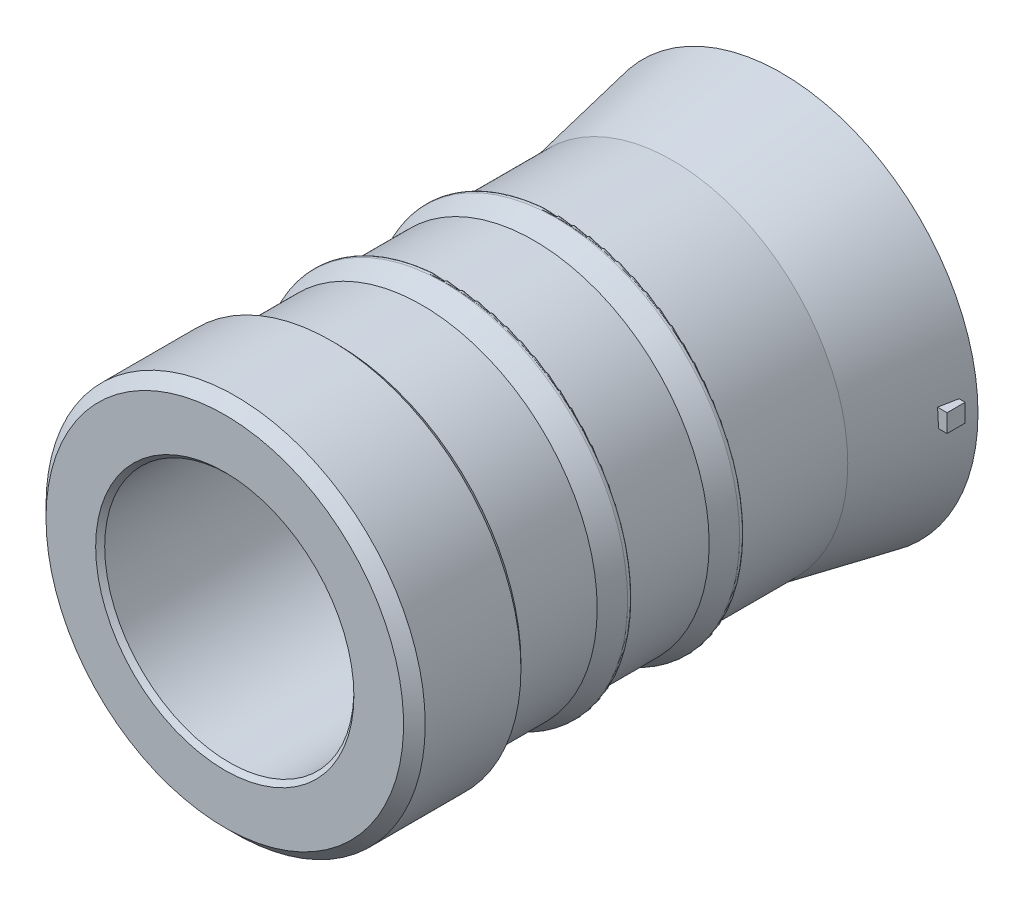
ISO-10303-21;
HEADER;
FILE_DESCRIPTION(('STEP AP214'),'2;1');
FILE_NAME('part.step','',(''),(''),'','','');
FILE_SCHEMA(('AUTOMOTIVE_DESIGN { 1 0 10303 214 1 1 1 1 }'));
ENDSEC;
DATA;
#1=APPLICATION_CONTEXT('core data for automotive mechanical design processes');
#2=APPLICATION_PROTOCOL_DEFINITION('international standard','automotive_design',2000,#1);
#3=PRODUCT_CONTEXT('',#1,'mechanical');
#4=PRODUCT('Part','Part','',(#3));
#5=PRODUCT_RELATED_PRODUCT_CATEGORY('part','',(#4));
#6=PRODUCT_DEFINITION_FORMATION('','',#4);
#7=PRODUCT_DEFINITION_CONTEXT('part definition',#1,'design');
#8=PRODUCT_DEFINITION('design','',#6,#7);
#9=PRODUCT_DEFINITION_SHAPE('','',#8);
#10=(LENGTH_UNIT() NAMED_UNIT(*) SI_UNIT(.MILLI.,.METRE.));
#11=(NAMED_UNIT(*) PLANE_ANGLE_UNIT() SI_UNIT($,.RADIAN.));
#12=(NAMED_UNIT(*) SI_UNIT($,.STERADIAN.) SOLID_ANGLE_UNIT());
#13=UNCERTAINTY_MEASURE_WITH_UNIT(LENGTH_MEASURE(1.E-05),#10,'distance_accuracy_value','');
#14=(GEOMETRIC_REPRESENTATION_CONTEXT(3) GLOBAL_UNCERTAINTY_ASSIGNED_CONTEXT((#13)) GLOBAL_UNIT_ASSIGNED_CONTEXT((#10,
#11,#12)) REPRESENTATION_CONTEXT('',''));
#15=CARTESIAN_POINT('',(0.,0.,0.));
#16=DIRECTION('',(0.,0.,1.));
#17=DIRECTION('',(1.,0.,0.));
#18=AXIS2_PLACEMENT_3D('',#15,#16,#17);
#19=CARTESIAN_POINT('',(0.,0.,0.));
#20=DIRECTION('',(0.,0.,-1.));
#21=DIRECTION('',(0.,1.,0.));
#22=AXIS2_PLACEMENT_3D('',#19,#20,#21);
#23=CYLINDRICAL_SURFACE('',#22,8.763);
#24=CARTESIAN_POINT('',(0.,0.,0.205534515174355));
#25=DIRECTION('',(0.,0.,1.));
#26=DIRECTION('',(1.,0.,0.));
#27=AXIS2_PLACEMENT_3D('',#24,#25,#26);
#28=CIRCLE('',#27,8.763);
#29=CARTESIAN_POINT('',(8.763,0.,0.205534515174355));
#30=VERTEX_POINT('',#29);
#31=EDGE_CURVE('E285',#30,#30,#28,.F.);
#32=ORIENTED_EDGE('',*,*,#31,.T.);
#33=EDGE_LOOP('',(#32));
#34=FACE_BOUND('',#33,.T.);
#35=CARTESIAN_POINT('',(0.,0.,39.0525));
#36=DIRECTION('',(0.,0.,-1.));
#37=DIRECTION('',(0.,1.,0.));
#38=AXIS2_PLACEMENT_3D('',#35,#36,#37);
#39=CIRCLE('',#38,8.763);
#40=CARTESIAN_POINT('',(0.,8.763,39.0525));
#41=VERTEX_POINT('',#40);
#42=EDGE_CURVE('E13',#41,#41,#39,.F.);
#43=ORIENTED_EDGE('',*,*,#42,.T.);
#44=EDGE_LOOP('',(#43));
#45=FACE_BOUND('',#44,.T.);
#46=ADVANCED_FACE('F44',(#34,#45),#23,.F.);
#47=CARTESIAN_POINT('',(0.,0.,0.205534515174355));
#48=DIRECTION('',(0.,0.,-1.));
#49=DIRECTION('',(-1.,0.,0.));
#50=AXIS2_PLACEMENT_3D('',#47,#48,#49);
#51=CONICAL_SURFACE('',#50,13.8095986915523,0.191986217719377);
#52=CARTESIAN_POINT('',(0.,0.,2.54));
#53=DIRECTION('',(0.,0.,1.));
#54=DIRECTION('',(1.,0.,0.));
#55=AXIS2_PLACEMENT_3D('',#52,#53,#54);
#56=CIRCLE('',#55,13.3558245689406);
#57=CARTESIAN_POINT('',(13.2953055593438,1.27,2.54));
#58=VERTEX_POINT('',#57);
#59=CARTESIAN_POINT('',(13.3558245689406,0.,2.54));
#60=VERTEX_POINT('',#59);
#61=EDGE_CURVE('E124',#58,#60,#56,.F.);
#62=ORIENTED_EDGE('',*,*,#61,.F.);
#63=CARTESIAN_POINT('',(17.6044260152484,1.27000000000001,-19.5525232643127));
#64=CARTESIAN_POINT('',(16.8886573998722,1.27000000000001,-15.8799090445466));
#65=CARTESIAN_POINT('',(16.1727234592619,1.27,-12.2073269746275));
#66=CARTESIAN_POINT('',(14.7401996492221,1.27,-4.8622911370722));
#67=CARTESIAN_POINT('',(14.0236097798552,1.27,-1.18983736942373));
#68=CARTESIAN_POINT('',(12.9479889347349,1.27,4.31869974980727));
#69=CARTESIAN_POINT('',(12.5893259629308,1.27,6.15485495232974));
#70=CARTESIAN_POINT('',(11.8716757789712,1.27,9.82710197347871));
#71=CARTESIAN_POINT('',(11.5126885668193,1.27,11.6631937921059));
#72=CARTESIAN_POINT('',(10.7942941421532,1.27,15.3352954660029));
#73=CARTESIAN_POINT('',(10.434886929598,1.26999999999999,17.1713053212646));
#74=CARTESIAN_POINT('',(9.71548545883442,1.26999999999999,20.8432100827127));
#75=CARTESIAN_POINT('',(9.35549120060302,1.26999999999999,22.6791049888945));
#76=CARTESIAN_POINT('',(8.99511989349757,1.26999999999999,24.5149259452161));
#77=B_SPLINE_CURVE_WITH_KNOTS('',3,(#63,#64,#65,#66,#67,#68,#69,#70,#71,#72,#73,#74,#75,#76),
.UNSPECIFIED.,.F.,.F.,(4,2,2,2,2,2,4),(0.,11.2251406103062,22.4502801472978,28.0628504343464,
33.6754206581009,39.2879914274454,44.9005624159946),.UNSPECIFIED.);
#78=CARTESIAN_POINT('',(13.5432717205639,1.27,1.27));
#79=VERTEX_POINT('',#78);
#80=EDGE_CURVE('E113',#79,#58,#77,.T.);
#81=ORIENTED_EDGE('',*,*,#80,.F.);
#82=CARTESIAN_POINT('',(0.,0.,1.27));
#83=DIRECTION('',(0.,0.,-1.));
#84=DIRECTION('',(0.,1.,0.));
#85=AXIS2_PLACEMENT_3D('',#82,#83,#84);
#86=CIRCLE('',#85,13.6026875615455);
#87=CARTESIAN_POINT('',(13.6026875615455,0.,1.27));
#88=VERTEX_POINT('',#87);
#89=EDGE_CURVE('E66',#88,#79,#86,.F.);
#90=ORIENTED_EDGE('',*,*,#89,.F.);
#91=DIRECTION('',(-0.190808995376546,0.,0.981627183447664));
#92=VECTOR('',#91,1.);
#93=CARTESIAN_POINT('',(0.,0.,71.249760922738));
#94=LINE('',#93,#92);
#95=EDGE_CURVE('E59',#60,#88,#94,.F.);
#96=ORIENTED_EDGE('',*,*,#95,.F.);
#97=EDGE_LOOP('',(#62,#81,#90,#96));
#98=FACE_BOUND('',#97,.T.);
#99=CARTESIAN_POINT('',(0.,0.,7.87399999999999));
#100=DIRECTION('',(0.,0.,1.));
#101=DIRECTION('',(1.,0.,0.));
#102=AXIS2_PLACEMENT_3D('',#99,#100,#101);
#103=CIRCLE('',#102,12.319);
#104=CARTESIAN_POINT('',(12.319,0.,7.87399999999999));
#105=VERTEX_POINT('',#104);
#106=EDGE_CURVE('E247',#105,#105,#103,.T.);
#107=ORIENTED_EDGE('',*,*,#106,.F.);
#108=EDGE_LOOP('',(#107));
#109=FACE_BOUND('',#108,.T.);
#110=CARTESIAN_POINT('',(0.,0.,0.205534515174355));
#111=DIRECTION('',(0.,0.,1.));
#112=DIRECTION('',(1.,0.,0.));
#113=AXIS2_PLACEMENT_3D('',#110,#111,#112);
#114=CIRCLE('',#113,13.8095986915523);
#115=CARTESIAN_POINT('',(13.8095986915523,0.,0.205534515174355));
#116=VERTEX_POINT('',#115);
#117=EDGE_CURVE('E125',#116,#116,#114,.T.);
#118=ORIENTED_EDGE('',*,*,#117,.T.);
#119=EDGE_LOOP('',(#118));
#120=FACE_BOUND('',#119,.T.);
#121=ADVANCED_FACE('F144',(#98,#109,#120),#51,.T.);
#122=CARTESIAN_POINT('',(0.,0.,39.37));
#123=DIRECTION('',(0.,0.,1.));
#124=DIRECTION('',(1.,0.,0.));
#125=AXIS2_PLACEMENT_3D('',#122,#123,#124);
#126=CYLINDRICAL_SURFACE('',#125,12.319);
#127=CARTESIAN_POINT('',(0.,0.,15.494));
#128=DIRECTION('',(0.,0.,1.));
#129=DIRECTION('',(1.,0.,0.));
#130=AXIS2_PLACEMENT_3D('',#127,#128,#129);
#131=CIRCLE('',#130,12.319);
#132=CARTESIAN_POINT('',(12.319,0.,15.494));
#133=VERTEX_POINT('',#132);
#134=EDGE_CURVE('E250',#133,#133,#131,.T.);
#135=ORIENTED_EDGE('',*,*,#134,.F.);
#136=EDGE_LOOP('',(#135));
#137=FACE_BOUND('',#136,.T.);
#138=ORIENTED_EDGE('',*,*,#106,.T.);
#139=EDGE_LOOP('',(#138));
#140=FACE_BOUND('',#139,.T.);
#141=ADVANCED_FACE('F151',(#137,#140),#126,.T.);
#142=CARTESIAN_POINT('',(0.,0.,15.494));
#143=DIRECTION('',(0.,0.,1.));
#144=DIRECTION('',(1.,0.,0.));
#145=AXIS2_PLACEMENT_3D('',#142,#143,#144);
#146=TOROIDAL_SURFACE('',#145,12.573,0.254000000000002);
#147=CARTESIAN_POINT('',(0.,0.,15.748));
#148=DIRECTION('',(0.,0.,1.));
#149=DIRECTION('',(1.,0.,0.));
#150=AXIS2_PLACEMENT_3D('',#147,#148,#149);
#151=CIRCLE('',#150,12.573);
#152=CARTESIAN_POINT('',(12.573,0.,15.748));
#153=VERTEX_POINT('',#152);
#154=EDGE_CURVE('E253',#153,#153,#151,.T.);
#155=ORIENTED_EDGE('',*,*,#154,.F.);
#156=EDGE_LOOP('',(#155));
#157=FACE_BOUND('',#156,.T.);
#158=ORIENTED_EDGE('',*,*,#134,.T.);
#159=EDGE_LOOP('',(#158));
#160=FACE_BOUND('',#159,.T.);
#161=ADVANCED_FACE('F210',(#157,#160),#146,.F.);
#162=CARTESIAN_POINT('',(0.,12.7,15.748));
#163=DIRECTION('',(0.,0.,1.));
#164=DIRECTION('',(1.,0.,0.));
#165=AXIS2_PLACEMENT_3D('',#162,#163,#164);
#166=PLANE('',#165);
#167=CARTESIAN_POINT('',(0.,0.,15.748));
#168=DIRECTION('',(0.,0.,1.));
#169=DIRECTION('',(1.,0.,0.));
#170=AXIS2_PLACEMENT_3D('',#167,#168,#169);
#171=CIRCLE('',#170,12.7);
#172=CARTESIAN_POINT('',(12.7,0.,15.748));
#173=VERTEX_POINT('',#172);
#174=EDGE_CURVE('E256',#173,#173,#171,.T.);
#175=ORIENTED_EDGE('',*,*,#174,.F.);
#176=EDGE_LOOP('',(#175));
#177=FACE_BOUND('',#176,.T.);
#178=ORIENTED_EDGE('',*,*,#154,.T.);
#179=EDGE_LOOP('',(#178));
#180=FACE_BOUND('',#179,.T.);
#181=ADVANCED_FACE('F206',(#177,#180),#166,.F.);
#182=CARTESIAN_POINT('',(0.,0.,16.002));
#183=DIRECTION('',(0.,0.,1.));
#184=DIRECTION('',(1.,0.,0.));
#185=AXIS2_PLACEMENT_3D('',#182,#183,#184);
#186=TOROIDAL_SURFACE('',#185,12.7,0.253999999999997);
#187=CARTESIAN_POINT('',(0.,0.,16.0971500747276));
#188=DIRECTION('',(0.,0.,1.));
#189=DIRECTION('',(1.,0.,0.));
#190=AXIS2_PLACEMENT_3D('',#187,#188,#189);
#191=CIRCLE('',#190,12.93550469906);
#192=CARTESIAN_POINT('',(12.93550469906,0.,16.0971500747276));
#193=VERTEX_POINT('',#192);
#194=EDGE_CURVE('E259',#193,#193,#191,.T.);
#195=ORIENTED_EDGE('',*,*,#194,.F.);
#196=EDGE_LOOP('',(#195));
#197=FACE_BOUND('',#196,.T.);
#198=ORIENTED_EDGE('',*,*,#174,.T.);
#199=EDGE_LOOP('',(#198));
#200=FACE_BOUND('',#199,.T.);
#201=ADVANCED_FACE('F202',(#197,#200),#186,.T.);
#202=CARTESIAN_POINT('',(0.,0.,16.0971500747276));
#203=DIRECTION('',(0.,0.,-1.));
#204=DIRECTION('',(-1.,0.,0.));
#205=AXIS2_PLACEMENT_3D('',#202,#203,#204);
#206=CONICAL_SURFACE('',#205,12.93550469906,0.383972435438752);
#207=CARTESIAN_POINT('',(0.,0.,17.6230527504403));
#208=DIRECTION('',(0.,0.,1.));
#209=DIRECTION('',(1.,0.,0.));
#210=AXIS2_PLACEMENT_3D('',#207,#208,#209);
#211=CIRCLE('',#210,12.319);
#212=CARTESIAN_POINT('',(12.319,0.,17.6230527504403));
#213=VERTEX_POINT('',#212);
#214=EDGE_CURVE('E262',#213,#213,#211,.T.);
#215=ORIENTED_EDGE('',*,*,#214,.F.);
#216=EDGE_LOOP('',(#215));
#217=FACE_BOUND('',#216,.T.);
#218=ORIENTED_EDGE('',*,*,#194,.T.);
#219=EDGE_LOOP('',(#218));
#220=FACE_BOUND('',#219,.T.);
#221=ADVANCED_FACE('F198',(#217,#220),#206,.T.);
#222=CARTESIAN_POINT('',(0.,0.,39.37));
#223=DIRECTION('',(0.,0.,1.));
#224=DIRECTION('',(1.,0.,0.));
#225=AXIS2_PLACEMENT_3D('',#222,#223,#224);
#226=CYLINDRICAL_SURFACE('',#225,12.319);
#227=CARTESIAN_POINT('',(0.,0.,23.368));
#228=DIRECTION('',(0.,0.,1.));
#229=DIRECTION('',(1.,0.,0.));
#230=AXIS2_PLACEMENT_3D('',#227,#228,#229);
#231=CIRCLE('',#230,12.319);
#232=CARTESIAN_POINT('',(12.319,0.,23.368));
#233=VERTEX_POINT('',#232);
#234=EDGE_CURVE('E265',#233,#233,#231,.T.);
#235=ORIENTED_EDGE('',*,*,#234,.F.);
#236=EDGE_LOOP('',(#235));
#237=FACE_BOUND('',#236,.T.);
#238=ORIENTED_EDGE('',*,*,#214,.T.);
#239=EDGE_LOOP('',(#238));
#240=FACE_BOUND('',#239,.T.);
#241=ADVANCED_FACE('F194',(#237,#240),#226,.T.);
#242=CARTESIAN_POINT('',(0.,0.,23.368));
#243=DIRECTION('',(0.,0.,1.));
#244=DIRECTION('',(1.,0.,0.));
#245=AXIS2_PLACEMENT_3D('',#242,#243,#244);
#246=TOROIDAL_SURFACE('',#245,12.573,0.254000000000001);
#247=CARTESIAN_POINT('',(0.,0.,23.622));
#248=DIRECTION('',(0.,0.,1.));
#249=DIRECTION('',(1.,0.,0.));
#250=AXIS2_PLACEMENT_3D('',#247,#248,#249);
#251=CIRCLE('',#250,12.573);
#252=CARTESIAN_POINT('',(12.573,0.,23.622));
#253=VERTEX_POINT('',#252);
#254=EDGE_CURVE('E268',#253,#253,#251,.T.);
#255=ORIENTED_EDGE('',*,*,#254,.F.);
#256=EDGE_LOOP('',(#255));
#257=FACE_BOUND('',#256,.T.);
#258=ORIENTED_EDGE('',*,*,#234,.T.);
#259=EDGE_LOOP('',(#258));
#260=FACE_BOUND('',#259,.T.);
#261=ADVANCED_FACE('F190',(#257,#260),#246,.F.);
#262=CARTESIAN_POINT('',(0.,12.7,23.622));
#263=DIRECTION('',(0.,0.,1.));
#264=DIRECTION('',(1.,0.,0.));
#265=AXIS2_PLACEMENT_3D('',#262,#263,#264);
#266=PLANE('',#265);
#267=CARTESIAN_POINT('',(0.,0.,23.622));
#268=DIRECTION('',(0.,0.,1.));
#269=DIRECTION('',(1.,0.,0.));
#270=AXIS2_PLACEMENT_3D('',#267,#268,#269);
#271=CIRCLE('',#270,12.7);
#272=CARTESIAN_POINT('',(12.7,0.,23.622));
#273=VERTEX_POINT('',#272);
#274=EDGE_CURVE('E271',#273,#273,#271,.T.);
#275=ORIENTED_EDGE('',*,*,#274,.F.);
#276=EDGE_LOOP('',(#275));
#277=FACE_BOUND('',#276,.T.);
#278=ORIENTED_EDGE('',*,*,#254,.T.);
#279=EDGE_LOOP('',(#278));
#280=FACE_BOUND('',#279,.T.);
#281=ADVANCED_FACE('F186',(#277,#280),#266,.F.);
#282=CARTESIAN_POINT('',(0.,0.,23.876));
#283=DIRECTION('',(0.,0.,1.));
#284=DIRECTION('',(1.,0.,0.));
#285=AXIS2_PLACEMENT_3D('',#282,#283,#284);
#286=TOROIDAL_SURFACE('',#285,12.7,0.254);
#287=CARTESIAN_POINT('',(0.,0.,23.9711500747276));
#288=DIRECTION('',(0.,0.,1.));
#289=DIRECTION('',(1.,0.,0.));
#290=AXIS2_PLACEMENT_3D('',#287,#288,#289);
#291=CIRCLE('',#290,12.93550469906);
#292=CARTESIAN_POINT('',(12.93550469906,0.,23.9711500747276));
#293=VERTEX_POINT('',#292);
#294=EDGE_CURVE('E274',#293,#293,#291,.T.);
#295=ORIENTED_EDGE('',*,*,#294,.F.);
#296=EDGE_LOOP('',(#295));
#297=FACE_BOUND('',#296,.T.);
#298=ORIENTED_EDGE('',*,*,#274,.T.);
#299=EDGE_LOOP('',(#298));
#300=FACE_BOUND('',#299,.T.);
#301=ADVANCED_FACE('F182',(#297,#300),#286,.T.);
#302=CARTESIAN_POINT('',(0.,0.,23.9711500747276));
#303=DIRECTION('',(0.,0.,-1.));
#304=DIRECTION('',(-1.,0.,0.));
#305=AXIS2_PLACEMENT_3D('',#302,#303,#304);
#306=CONICAL_SURFACE('',#305,12.93550469906,0.383972435438754);
#307=CARTESIAN_POINT('',(0.,0.,25.4970527504403));
#308=DIRECTION('',(0.,0.,1.));
#309=DIRECTION('',(1.,0.,0.));
#310=AXIS2_PLACEMENT_3D('',#307,#308,#309);
#311=CIRCLE('',#310,12.319);
#312=CARTESIAN_POINT('',(12.319,0.,25.4970527504403));
#313=VERTEX_POINT('',#312);
#314=EDGE_CURVE('E277',#313,#313,#311,.T.);
#315=ORIENTED_EDGE('',*,*,#314,.F.);
#316=EDGE_LOOP('',(#315));
#317=FACE_BOUND('',#316,.T.);
#318=ORIENTED_EDGE('',*,*,#294,.T.);
#319=EDGE_LOOP('',(#318));
#320=FACE_BOUND('',#319,.T.);
#321=ADVANCED_FACE('F178',(#317,#320),#306,.T.);
#322=CARTESIAN_POINT('',(0.,0.,39.37));
#323=DIRECTION('',(0.,0.,1.));
#324=DIRECTION('',(1.,0.,0.));
#325=AXIS2_PLACEMENT_3D('',#322,#323,#324);
#326=CYLINDRICAL_SURFACE('',#325,12.319);
#327=CARTESIAN_POINT('',(0.,0.,31.242));
#328=DIRECTION('',(0.,0.,1.));
#329=DIRECTION('',(1.,0.,0.));
#330=AXIS2_PLACEMENT_3D('',#327,#328,#329);
#331=CIRCLE('',#330,12.319);
#332=CARTESIAN_POINT('',(12.319,0.,31.242));
#333=VERTEX_POINT('',#332);
#334=EDGE_CURVE('E280',#333,#333,#331,.T.);
#335=ORIENTED_EDGE('',*,*,#334,.F.);
#336=EDGE_LOOP('',(#335));
#337=FACE_BOUND('',#336,.T.);
#338=ORIENTED_EDGE('',*,*,#314,.T.);
#339=EDGE_LOOP('',(#338));
#340=FACE_BOUND('',#339,.T.);
#341=ADVANCED_FACE('F174',(#337,#340),#326,.T.);
#342=CARTESIAN_POINT('',(0.,0.,31.242));
#343=DIRECTION('',(0.,0.,1.));
#344=DIRECTION('',(1.,0.,0.));
#345=AXIS2_PLACEMENT_3D('',#342,#343,#344);
#346=TOROIDAL_SURFACE('',#345,12.573,0.253999999999999);
#347=CARTESIAN_POINT('',(0.,0.,31.496));
#348=DIRECTION('',(0.,0.,1.));
#349=DIRECTION('',(1.,0.,0.));
#350=AXIS2_PLACEMENT_3D('',#347,#348,#349);
#351=CIRCLE('',#350,12.573);
#352=CARTESIAN_POINT('',(12.573,0.,31.496));
#353=VERTEX_POINT('',#352);
#354=EDGE_CURVE('E283',#353,#353,#351,.T.);
#355=ORIENTED_EDGE('',*,*,#354,.F.);
#356=EDGE_LOOP('',(#355));
#357=FACE_BOUND('',#356,.T.);
#358=ORIENTED_EDGE('',*,*,#334,.T.);
#359=EDGE_LOOP('',(#358));
#360=FACE_BOUND('',#359,.T.);
#361=ADVANCED_FACE('F170',(#357,#360),#346,.F.);
#362=CARTESIAN_POINT('',(0.,12.573,31.496));
#363=DIRECTION('',(0.,0.,1.));
#364=DIRECTION('',(1.,0.,0.));
#365=AXIS2_PLACEMENT_3D('',#362,#363,#364);
#366=PLANE('',#365);
#367=CARTESIAN_POINT('',(0.,0.,31.496));
#368=DIRECTION('',(0.,0.,1.));
#369=DIRECTION('',(1.,0.,0.));
#370=AXIS2_PLACEMENT_3D('',#367,#368,#369);
#371=CIRCLE('',#370,12.954);
#372=CARTESIAN_POINT('',(12.954,0.,31.496));
#373=VERTEX_POINT('',#372);
#374=EDGE_CURVE('E235',#373,#373,#371,.F.);
#375=ORIENTED_EDGE('',*,*,#374,.T.);
#376=EDGE_LOOP('',(#375));
#377=FACE_BOUND('',#376,.T.);
#378=ORIENTED_EDGE('',*,*,#354,.T.);
#379=EDGE_LOOP('',(#378));
#380=FACE_BOUND('',#379,.T.);
#381=ADVANCED_FACE('F166',(#377,#380),#366,.F.);
#382=CARTESIAN_POINT('',(0.,0.,39.37));
#383=DIRECTION('',(0.,0.,1.));
#384=DIRECTION('',(1.,0.,0.));
#385=AXIS2_PLACEMENT_3D('',#382,#383,#384);
#386=CYLINDRICAL_SURFACE('',#385,13.335);
#387=CARTESIAN_POINT('',(0.,0.,38.608));
#388=DIRECTION('',(0.,0.,-1.));
#389=DIRECTION('',(-1.,0.,0.));
#390=AXIS2_PLACEMENT_3D('',#387,#388,#389);
#391=CIRCLE('',#390,13.335);
#392=CARTESIAN_POINT('',(-13.335,0.,38.608));
#393=VERTEX_POINT('',#392);
#394=EDGE_CURVE('E230',#393,#393,#391,.T.);
#395=ORIENTED_EDGE('',*,*,#394,.T.);
#396=EDGE_LOOP('',(#395));
#397=FACE_BOUND('',#396,.T.);
#398=CARTESIAN_POINT('',(0.,0.,31.877));
#399=DIRECTION('',(0.,0.,1.));
#400=DIRECTION('',(1.,0.,0.));
#401=AXIS2_PLACEMENT_3D('',#398,#399,#400);
#402=CIRCLE('',#401,13.335);
#403=CARTESIAN_POINT('',(13.335,0.,31.877));
#404=VERTEX_POINT('',#403);
#405=EDGE_CURVE('E239',#404,#404,#402,.T.);
#406=ORIENTED_EDGE('',*,*,#405,.T.);
#407=EDGE_LOOP('',(#406));
#408=FACE_BOUND('',#407,.T.);
#409=ADVANCED_FACE('F162',(#397,#408),#386,.T.);
#410=CARTESIAN_POINT('',(0.,0.,39.37));
#411=DIRECTION('',(0.,0.,-1.));
#412=DIRECTION('',(-1.,0.,0.));
#413=AXIS2_PLACEMENT_3D('',#410,#411,#412);
#414=PLANE('',#413);
#415=CARTESIAN_POINT('',(0.,0.,39.37));
#416=DIRECTION('',(0.,0.,-1.));
#417=DIRECTION('',(-1.,0.,0.));
#418=AXIS2_PLACEMENT_3D('',#415,#416,#417);
#419=CIRCLE('',#418,9.08050000000001);
#420=CARTESIAN_POINT('',(-9.08050000000001,0.,39.37));
#421=VERTEX_POINT('',#420);
#422=EDGE_CURVE('E52',#421,#421,#419,.T.);
#423=ORIENTED_EDGE('',*,*,#422,.T.);
#424=EDGE_LOOP('',(#423));
#425=FACE_BOUND('',#424,.T.);
#426=CARTESIAN_POINT('',(0.,0.,39.37));
#427=DIRECTION('',(0.,0.,-1.));
#428=DIRECTION('',(-1.,0.,0.));
#429=AXIS2_PLACEMENT_3D('',#426,#427,#428);
#430=CIRCLE('',#429,12.573);
#431=CARTESIAN_POINT('',(-12.573,0.,39.37));
#432=VERTEX_POINT('',#431);
#433=EDGE_CURVE('E233',#432,#432,#430,.F.);
#434=ORIENTED_EDGE('',*,*,#433,.T.);
#435=EDGE_LOOP('',(#434));
#436=FACE_BOUND('',#435,.T.);
#437=ADVANCED_FACE('F158',(#425,#436),#414,.F.);
#438=CARTESIAN_POINT('',(0.,0.,31.877));
#439=DIRECTION('',(0.,0.,1.));
#440=DIRECTION('',(1.,0.,0.));
#441=AXIS2_PLACEMENT_3D('',#438,#439,#440);
#442=CONICAL_SURFACE('',#441,13.335,0.785398163397439);
#443=ORIENTED_EDGE('',*,*,#374,.F.);
#444=EDGE_LOOP('',(#443));
#445=FACE_BOUND('',#444,.T.);
#446=ORIENTED_EDGE('',*,*,#405,.F.);
#447=EDGE_LOOP('',(#446));
#448=FACE_BOUND('',#447,.T.);
#449=ADVANCED_FACE('F161',(#445,#448),#442,.T.);
#450=CARTESIAN_POINT('',(0.,0.,39.37));
#451=DIRECTION('',(0.,0.,-1.));
#452=DIRECTION('',(-1.,0.,0.));
#453=AXIS2_PLACEMENT_3D('',#450,#451,#452);
#454=CONICAL_SURFACE('',#453,12.573,0.785398163397444);
#455=ORIENTED_EDGE('',*,*,#394,.F.);
#456=EDGE_LOOP('',(#455));
#457=FACE_BOUND('',#456,.T.);
#458=ORIENTED_EDGE('',*,*,#433,.F.);
#459=EDGE_LOOP('',(#458));
#460=FACE_BOUND('',#459,.T.);
#461=ADVANCED_FACE('F219',(#457,#460),#454,.T.);
#462=CARTESIAN_POINT('',(0.,0.,39.37));
#463=DIRECTION('',(0.,0.,1.));
#464=DIRECTION('',(0.,-1.,0.));
#465=AXIS2_PLACEMENT_3D('',#462,#463,#464);
#466=CONICAL_SURFACE('',#465,9.08050000000001,0.785398163397451);
#467=ORIENTED_EDGE('',*,*,#42,.F.);
#468=EDGE_LOOP('',(#467));
#469=FACE_BOUND('',#468,.T.);
#470=ORIENTED_EDGE('',*,*,#422,.F.);
#471=EDGE_LOOP('',(#470));
#472=FACE_BOUND('',#471,.T.);
#473=ADVANCED_FACE('F46',(#469,#472),#466,.F.);
#474=CARTESIAN_POINT('',(0.,0.,0.205534515174355));
#475=DIRECTION('',(0.,0.,1.));
#476=DIRECTION('',(1.,0.,0.));
#477=AXIS2_PLACEMENT_3D('',#474,#475,#476);
#478=PLANE('',#477);
#479=ORIENTED_EDGE('',*,*,#117,.F.);
#480=EDGE_LOOP('',(#479));
#481=FACE_BOUND('',#480,.T.);
#482=ORIENTED_EDGE('',*,*,#31,.F.);
#483=EDGE_LOOP('',(#482));
#484=FACE_BOUND('',#483,.T.);
#485=ADVANCED_FACE('F134',(#481,#484),#478,.F.);
#486=CARTESIAN_POINT('',(13.97,0.,0.));
#487=DIRECTION('',(1.,0.,0.));
#488=DIRECTION('',(0.,0.,-1.));
#489=AXIS2_PLACEMENT_3D('',#486,#487,#488);
#490=PLANE('',#489);
#491=DIRECTION('',(0.,1.,0.));
#492=VECTOR('',#491,1.);
#493=CARTESIAN_POINT('',(13.97,0.,1.27));
#494=LINE('',#493,#492);
#495=CARTESIAN_POINT('',(13.97,0.,1.27));
#496=VERTEX_POINT('',#495);
#497=CARTESIAN_POINT('',(13.97,1.27,1.27));
#498=VERTEX_POINT('',#497);
#499=EDGE_CURVE('E87',#496,#498,#494,.T.);
#500=ORIENTED_EDGE('',*,*,#499,.T.);
#501=DIRECTION('',(0.,0.,1.));
#502=VECTOR('',#501,1.);
#503=CARTESIAN_POINT('',(13.97,1.27,1.27));
#504=LINE('',#503,#502);
#505=CARTESIAN_POINT('',(13.97,1.27,2.54));
#506=VERTEX_POINT('',#505);
#507=EDGE_CURVE('E96',#498,#506,#504,.T.);
#508=ORIENTED_EDGE('',*,*,#507,.T.);
#509=DIRECTION('',(0.,-1.,0.));
#510=VECTOR('',#509,1.);
#511=CARTESIAN_POINT('',(13.97,0.,2.54));
#512=LINE('',#511,#510);
#513=CARTESIAN_POINT('',(13.97,0.,2.54));
#514=VERTEX_POINT('',#513);
#515=EDGE_CURVE('E101',#506,#514,#512,.T.);
#516=ORIENTED_EDGE('',*,*,#515,.T.);
#517=DIRECTION('',(0.,0.,-1.));
#518=VECTOR('',#517,1.);
#519=CARTESIAN_POINT('',(13.97,0.,1.27));
#520=LINE('',#519,#518);
#521=EDGE_CURVE('E93',#514,#496,#520,.T.);
#522=ORIENTED_EDGE('',*,*,#521,.T.);
#523=EDGE_LOOP('',(#500,#508,#516,#522));
#524=FACE_BOUND('',#523,.T.);
#525=ADVANCED_FACE('F103',(#524),#490,.T.);
#526=CARTESIAN_POINT('',(-13.8105986915523,1.27,1.27));
#527=DIRECTION('',(0.,1.,0.));
#528=DIRECTION('',(0.,0.,1.));
#529=AXIS2_PLACEMENT_3D('',#526,#527,#528);
#530=PLANE('',#529);
#531=DIRECTION('',(1.,0.,0.));
#532=VECTOR('',#531,1.);
#533=CARTESIAN_POINT('',(-13.8105986915523,1.27,1.27));
#534=LINE('',#533,#532);
#535=EDGE_CURVE('E83',#79,#498,#534,.T.);
#536=ORIENTED_EDGE('',*,*,#535,.F.);
#537=ORIENTED_EDGE('',*,*,#80,.T.);
#538=DIRECTION('',(1.,0.,0.));
#539=VECTOR('',#538,1.);
#540=CARTESIAN_POINT('',(-13.8105986915523,1.27,2.54));
#541=LINE('',#540,#539);
#542=EDGE_CURVE('E92',#58,#506,#541,.T.);
#543=ORIENTED_EDGE('',*,*,#542,.T.);
#544=ORIENTED_EDGE('',*,*,#507,.F.);
#545=EDGE_LOOP('',(#536,#537,#543,#544));
#546=FACE_BOUND('',#545,.T.);
#547=ADVANCED_FACE('F97',(#546),#530,.T.);
#548=CARTESIAN_POINT('',(-13.8105986915523,0.,2.54));
#549=DIRECTION('',(0.,0.,1.));
#550=DIRECTION('',(1.,0.,0.));
#551=AXIS2_PLACEMENT_3D('',#548,#549,#550);
#552=PLANE('',#551);
#553=ORIENTED_EDGE('',*,*,#542,.F.);
#554=ORIENTED_EDGE('',*,*,#61,.T.);
#555=DIRECTION('',(1.,0.,0.));
#556=VECTOR('',#555,1.);
#557=CARTESIAN_POINT('',(-13.8105986915523,0.,2.54));
#558=LINE('',#557,#556);
#559=EDGE_CURVE('E114',#60,#514,#558,.T.);
#560=ORIENTED_EDGE('',*,*,#559,.T.);
#561=ORIENTED_EDGE('',*,*,#515,.F.);
#562=EDGE_LOOP('',(#553,#554,#560,#561));
#563=FACE_BOUND('',#562,.T.);
#564=ADVANCED_FACE('F137',(#563),#552,.T.);
#565=CARTESIAN_POINT('',(-13.8105986915523,0.,1.27));
#566=DIRECTION('',(0.,-1.,0.));
#567=DIRECTION('',(0.,0.,-1.));
#568=AXIS2_PLACEMENT_3D('',#565,#566,#567);
#569=PLANE('',#568);
#570=ORIENTED_EDGE('',*,*,#559,.F.);
#571=ORIENTED_EDGE('',*,*,#95,.T.);
#572=DIRECTION('',(1.,0.,0.));
#573=VECTOR('',#572,1.);
#574=CARTESIAN_POINT('',(-13.8105986915523,0.,1.27));
#575=LINE('',#574,#573);
#576=EDGE_CURVE('E111',#88,#496,#575,.T.);
#577=ORIENTED_EDGE('',*,*,#576,.T.);
#578=ORIENTED_EDGE('',*,*,#521,.F.);
#579=EDGE_LOOP('',(#570,#571,#577,#578));
#580=FACE_BOUND('',#579,.T.);
#581=ADVANCED_FACE('F135',(#580),#569,.T.);
#582=CARTESIAN_POINT('',(-13.8105986915523,0.,1.27));
#583=DIRECTION('',(0.,0.,-1.));
#584=DIRECTION('',(0.,1.,0.));
#585=AXIS2_PLACEMENT_3D('',#582,#583,#584);
#586=PLANE('',#585);
#587=ORIENTED_EDGE('',*,*,#576,.F.);
#588=ORIENTED_EDGE('',*,*,#89,.T.);
#589=ORIENTED_EDGE('',*,*,#535,.T.);
#590=ORIENTED_EDGE('',*,*,#499,.F.);
#591=EDGE_LOOP('',(#587,#588,#589,#590));
#592=FACE_BOUND('',#591,.T.);
#593=ADVANCED_FACE('F85',(#592),#586,.T.);
#594=CLOSED_SHELL('',(#46,#121,#141,#161,#181,#201,#221,#241,#261,#281,#301,#321,#341,#361,#381,
#409,#437,#449,#461,#473,#485,#525,#547,#564,#581,#593));
#595=MANIFOLD_SOLID_BREP('B2',#594);
#596=ADVANCED_BREP_SHAPE_REPRESENTATION('',(#18,#595),#14);
#597=SHAPE_DEFINITION_REPRESENTATION(#9,#596);
ENDSEC;
END-ISO-10303-21;
